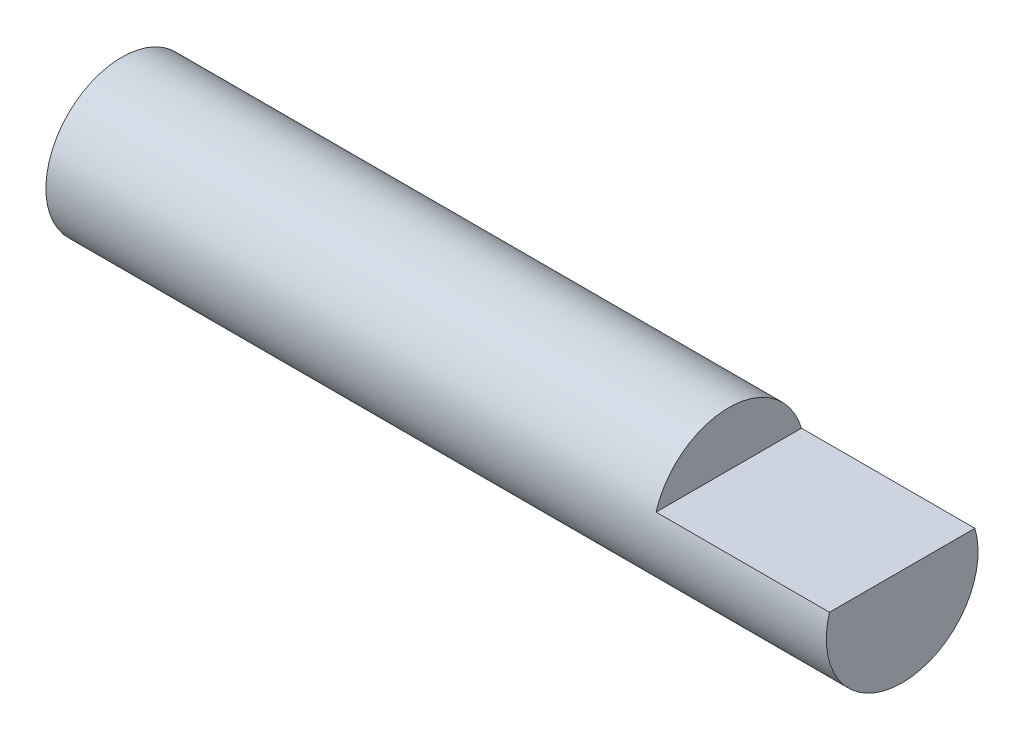
ISO-10303-21;
HEADER;
FILE_DESCRIPTION(('STEP AP214'),'2;1');
FILE_NAME('part.step','',(''),(''),'','','');
FILE_SCHEMA(('AUTOMOTIVE_DESIGN { 1 0 10303 214 1 1 1 1 }'));
ENDSEC;
DATA;
#1=APPLICATION_CONTEXT('core data for automotive mechanical design processes');
#2=APPLICATION_PROTOCOL_DEFINITION('international standard','automotive_design',2000,#1);
#3=PRODUCT_CONTEXT('',#1,'mechanical');
#4=PRODUCT('Part','Part','',(#3));
#5=PRODUCT_RELATED_PRODUCT_CATEGORY('part','',(#4));
#6=PRODUCT_DEFINITION_FORMATION('','',#4);
#7=PRODUCT_DEFINITION_CONTEXT('part definition',#1,'design');
#8=PRODUCT_DEFINITION('design','',#6,#7);
#9=PRODUCT_DEFINITION_SHAPE('','',#8);
#10=(LENGTH_UNIT() NAMED_UNIT(*) SI_UNIT(.MILLI.,.METRE.));
#11=(NAMED_UNIT(*) PLANE_ANGLE_UNIT() SI_UNIT($,.RADIAN.));
#12=(NAMED_UNIT(*) SI_UNIT($,.STERADIAN.) SOLID_ANGLE_UNIT());
#13=UNCERTAINTY_MEASURE_WITH_UNIT(LENGTH_MEASURE(1.E-05),#10,'distance_accuracy_value','');
#14=(GEOMETRIC_REPRESENTATION_CONTEXT(3) GLOBAL_UNCERTAINTY_ASSIGNED_CONTEXT((#13)) GLOBAL_UNIT_ASSIGNED_CONTEXT((#10,
#11,#12)) REPRESENTATION_CONTEXT('',''));
#15=CARTESIAN_POINT('',(0.,0.,0.));
#16=DIRECTION('',(0.,0.,1.));
#17=DIRECTION('',(1.,0.,0.));
#18=AXIS2_PLACEMENT_3D('',#15,#16,#17);
#19=CARTESIAN_POINT('',(57.15,0.,0.));
#20=DIRECTION('',(-1.,0.,0.));
#21=DIRECTION('',(0.,0.,1.));
#22=AXIS2_PLACEMENT_3D('',#19,#20,#21);
#23=CYLINDRICAL_SURFACE('',#22,5.55625);
#24=CARTESIAN_POINT('',(57.15,0.,0.));
#25=DIRECTION('',(1.,0.,0.));
#26=DIRECTION('',(0.,0.,-1.));
#27=AXIS2_PLACEMENT_3D('',#24,#25,#26);
#28=CIRCLE('',#27,5.55625);
#29=CARTESIAN_POINT('',(57.15,1.5875,5.32463687142137));
#30=VERTEX_POINT('',#29);
#31=CARTESIAN_POINT('',(57.15,1.5875,-5.32463687142137));
#32=VERTEX_POINT('',#31);
#33=EDGE_CURVE('E11',#30,#32,#28,.T.);
#34=ORIENTED_EDGE('',*,*,#33,.F.);
#35=DIRECTION('',(1.,0.,0.));
#36=VECTOR('',#35,1.);
#37=CARTESIAN_POINT('',(44.45,1.5875,5.32463687142137));
#38=LINE('',#37,#36);
#39=CARTESIAN_POINT('',(44.45,1.5875,5.32463687142137));
#40=VERTEX_POINT('',#39);
#41=EDGE_CURVE('E55',#40,#30,#38,.T.);
#42=ORIENTED_EDGE('',*,*,#41,.F.);
#43=CARTESIAN_POINT('',(44.45,0.,0.));
#44=DIRECTION('',(1.,0.,0.));
#45=DIRECTION('',(0.,0.,-1.));
#46=AXIS2_PLACEMENT_3D('',#43,#44,#45);
#47=CIRCLE('',#46,5.55625);
#48=CARTESIAN_POINT('',(44.45,1.5875,-5.32463687142137));
#49=VERTEX_POINT('',#48);
#50=EDGE_CURVE('E70',#49,#40,#47,.T.);
#51=ORIENTED_EDGE('',*,*,#50,.F.);
#52=DIRECTION('',(1.,0.,0.));
#53=VECTOR('',#52,1.);
#54=CARTESIAN_POINT('',(44.45,1.5875,-5.32463687142137));
#55=LINE('',#54,#53);
#56=EDGE_CURVE('E61',#49,#32,#55,.T.);
#57=ORIENTED_EDGE('',*,*,#56,.T.);
#58=EDGE_LOOP('',(#34,#42,#51,#57));
#59=FACE_BOUND('',#58,.T.);
#60=CARTESIAN_POINT('',(0.,0.,0.));
#61=DIRECTION('',(1.,0.,0.));
#62=DIRECTION('',(0.,0.,-1.));
#63=AXIS2_PLACEMENT_3D('',#60,#61,#62);
#64=CIRCLE('',#63,5.55625);
#65=CARTESIAN_POINT('',(0.,0.,-5.55625));
#66=VERTEX_POINT('',#65);
#67=EDGE_CURVE('E44',#66,#66,#64,.T.);
#68=ORIENTED_EDGE('',*,*,#67,.T.);
#69=EDGE_LOOP('',(#68));
#70=FACE_BOUND('',#69,.T.);
#71=ADVANCED_FACE('F41',(#59,#70),#23,.T.);
#72=CARTESIAN_POINT('',(57.15,0.,0.));
#73=DIRECTION('',(1.,0.,0.));
#74=DIRECTION('',(0.,0.,-1.));
#75=AXIS2_PLACEMENT_3D('',#72,#73,#74);
#76=PLANE('',#75);
#77=DIRECTION('',(0.,0.,-1.));
#78=VECTOR('',#77,1.);
#79=CARTESIAN_POINT('',(57.15,1.5875,5.32463687142137));
#80=LINE('',#79,#78);
#81=EDGE_CURVE('E66',#30,#32,#80,.T.);
#82=ORIENTED_EDGE('',*,*,#81,.F.);
#83=ORIENTED_EDGE('',*,*,#33,.T.);
#84=EDGE_LOOP('',(#82,#83));
#85=FACE_BOUND('',#84,.T.);
#86=ADVANCED_FACE('F77',(#85),#76,.T.);
#87=CARTESIAN_POINT('',(0.,0.,0.));
#88=DIRECTION('',(1.,0.,0.));
#89=DIRECTION('',(0.,0.,-1.));
#90=AXIS2_PLACEMENT_3D('',#87,#88,#89);
#91=PLANE('',#90);
#92=ORIENTED_EDGE('',*,*,#67,.F.);
#93=EDGE_LOOP('',(#92));
#94=FACE_BOUND('',#93,.T.);
#95=ADVANCED_FACE('F79',(#94),#91,.F.);
#96=CARTESIAN_POINT('',(44.45,1.5875,5.32463687142137));
#97=DIRECTION('',(0.,-1.,0.));
#98=DIRECTION('',(0.,0.,-1.));
#99=AXIS2_PLACEMENT_3D('',#96,#97,#98);
#100=PLANE('',#99);
#101=ORIENTED_EDGE('',*,*,#81,.T.);
#102=ORIENTED_EDGE('',*,*,#56,.F.);
#103=DIRECTION('',(0.,0.,-1.));
#104=VECTOR('',#103,1.);
#105=CARTESIAN_POINT('',(44.45,1.5875,5.32463687142137));
#106=LINE('',#105,#104);
#107=EDGE_CURVE('E95',#40,#49,#106,.T.);
#108=ORIENTED_EDGE('',*,*,#107,.F.);
#109=ORIENTED_EDGE('',*,*,#41,.T.);
#110=EDGE_LOOP('',(#101,#102,#108,#109));
#111=FACE_BOUND('',#110,.T.);
#112=ADVANCED_FACE('F67',(#111),#100,.F.);
#113=CARTESIAN_POINT('',(44.45,0.,0.));
#114=DIRECTION('',(1.,0.,0.));
#115=DIRECTION('',(0.,0.,-1.));
#116=AXIS2_PLACEMENT_3D('',#113,#114,#115);
#117=PLANE('',#116);
#118=ORIENTED_EDGE('',*,*,#50,.T.);
#119=ORIENTED_EDGE('',*,*,#107,.T.);
#120=EDGE_LOOP('',(#118,#119));
#121=FACE_BOUND('',#120,.T.);
#122=ADVANCED_FACE('F89',(#121),#117,.T.);
#123=CLOSED_SHELL('',(#71,#86,#95,#112,#122));
#124=MANIFOLD_SOLID_BREP('B2',#123);
#125=ADVANCED_BREP_SHAPE_REPRESENTATION('',(#18,#124),#14);
#126=SHAPE_DEFINITION_REPRESENTATION(#9,#125);
ENDSEC;
END-ISO-10303-21;
